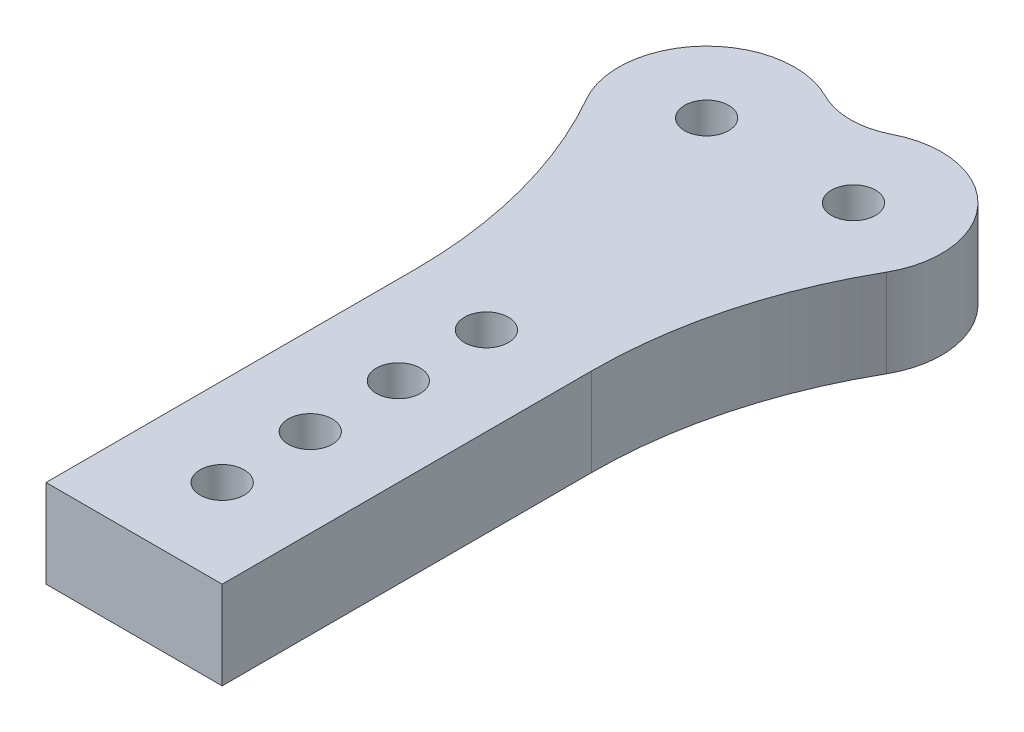
ISO-10303-21;
HEADER;
FILE_DESCRIPTION(('STEP AP214'),'2;1');
FILE_NAME('part.step','',(''),(''),'','','');
FILE_SCHEMA(('AUTOMOTIVE_DESIGN { 1 0 10303 214 1 1 1 1 }'));
ENDSEC;
DATA;
#1=APPLICATION_CONTEXT('core data for automotive mechanical design processes');
#2=APPLICATION_PROTOCOL_DEFINITION('international standard','automotive_design',2000,#1);
#3=PRODUCT_CONTEXT('',#1,'mechanical');
#4=PRODUCT('Part','Part','',(#3));
#5=PRODUCT_RELATED_PRODUCT_CATEGORY('part','',(#4));
#6=PRODUCT_DEFINITION_FORMATION('','',#4);
#7=PRODUCT_DEFINITION_CONTEXT('part definition',#1,'design');
#8=PRODUCT_DEFINITION('design','',#6,#7);
#9=PRODUCT_DEFINITION_SHAPE('','',#8);
#10=(LENGTH_UNIT() NAMED_UNIT(*) SI_UNIT(.MILLI.,.METRE.));
#11=(NAMED_UNIT(*) PLANE_ANGLE_UNIT() SI_UNIT($,.RADIAN.));
#12=(NAMED_UNIT(*) SI_UNIT($,.STERADIAN.) SOLID_ANGLE_UNIT());
#13=UNCERTAINTY_MEASURE_WITH_UNIT(LENGTH_MEASURE(1.E-05),#10,'distance_accuracy_value','');
#14=(GEOMETRIC_REPRESENTATION_CONTEXT(3) GLOBAL_UNCERTAINTY_ASSIGNED_CONTEXT((#13)) GLOBAL_UNIT_ASSIGNED_CONTEXT((#10,
#11,#12)) REPRESENTATION_CONTEXT('',''));
#15=CARTESIAN_POINT('',(0.,0.,0.));
#16=DIRECTION('',(0.,0.,1.));
#17=DIRECTION('',(1.,0.,0.));
#18=AXIS2_PLACEMENT_3D('',#15,#16,#17);
#19=CARTESIAN_POINT('',(-16.9314326925532,3.,1.11222006757747));
#20=DIRECTION('',(1.,0.,0.));
#21=DIRECTION('',(0.,0.,-1.));
#22=AXIS2_PLACEMENT_3D('',#19,#20,#21);
#23=PLANE('',#22);
#24=DIRECTION('',(0.,0.,1.));
#25=VECTOR('',#24,1.);
#26=CARTESIAN_POINT('',(-16.9314326925532,3.,1.11222006757747));
#27=LINE('',#26,#25);
#28=CARTESIAN_POINT('',(-16.9314326925532,3.,10.5329419082859));
#29=VERTEX_POINT('',#28);
#30=CARTESIAN_POINT('',(-16.9314326925532,3.,23.1122200675775));
#31=VERTEX_POINT('',#30);
#32=EDGE_CURVE('E108',#29,#31,#27,.T.);
#33=ORIENTED_EDGE('',*,*,#32,.F.);
#34=DIRECTION('',(0.,1.,0.));
#35=VECTOR('',#34,1.);
#36=CARTESIAN_POINT('',(-16.9314326925532,3.,10.5329419082859));
#37=LINE('',#36,#35);
#38=CARTESIAN_POINT('',(-16.9314326925532,0.,10.5329419082859));
#39=VERTEX_POINT('',#38);
#40=EDGE_CURVE('E149',#29,#39,#37,.F.);
#41=ORIENTED_EDGE('',*,*,#40,.T.);
#42=DIRECTION('',(0.,0.,1.));
#43=VECTOR('',#42,1.);
#44=CARTESIAN_POINT('',(-16.9314326925532,0.,1.11222006757747));
#45=LINE('',#44,#43);
#46=CARTESIAN_POINT('',(-16.9314326925532,0.,23.1122200675775));
#47=VERTEX_POINT('',#46);
#48=EDGE_CURVE('E132',#39,#47,#45,.T.);
#49=ORIENTED_EDGE('',*,*,#48,.T.);
#50=DIRECTION('',(0.,-1.,0.));
#51=VECTOR('',#50,1.);
#52=CARTESIAN_POINT('',(-16.9314326925532,3.,23.1122200675775));
#53=LINE('',#52,#51);
#54=EDGE_CURVE('E125',#31,#47,#53,.T.);
#55=ORIENTED_EDGE('',*,*,#54,.F.);
#56=EDGE_LOOP('',(#33,#41,#49,#55));
#57=FACE_BOUND('',#56,.T.);
#58=ADVANCED_FACE('F47',(#57),#23,.F.);
#59=CARTESIAN_POINT('',(-16.9314326925532,3.,23.1122200675775));
#60=DIRECTION('',(0.,0.,-1.));
#61=DIRECTION('',(-1.,0.,0.));
#62=AXIS2_PLACEMENT_3D('',#59,#60,#61);
#63=PLANE('',#62);
#64=DIRECTION('',(1.,0.,0.));
#65=VECTOR('',#64,1.);
#66=CARTESIAN_POINT('',(-16.9314326925532,0.,23.1122200675775));
#67=LINE('',#66,#65);
#68=CARTESIAN_POINT('',(-10.9314326925532,0.,23.1122200675775));
#69=VERTEX_POINT('',#68);
#70=EDGE_CURVE('E220',#47,#69,#67,.T.);
#71=ORIENTED_EDGE('',*,*,#70,.T.);
#72=DIRECTION('',(0.,-1.,0.));
#73=VECTOR('',#72,1.);
#74=CARTESIAN_POINT('',(-10.9314326925532,3.,23.1122200675775));
#75=LINE('',#74,#73);
#76=CARTESIAN_POINT('',(-10.9314326925532,3.,23.1122200675775));
#77=VERTEX_POINT('',#76);
#78=EDGE_CURVE('E127',#77,#69,#75,.T.);
#79=ORIENTED_EDGE('',*,*,#78,.F.);
#80=DIRECTION('',(1.,0.,0.));
#81=VECTOR('',#80,1.);
#82=CARTESIAN_POINT('',(-16.9314326925532,3.,23.1122200675775));
#83=LINE('',#82,#81);
#84=EDGE_CURVE('E111',#31,#77,#83,.T.);
#85=ORIENTED_EDGE('',*,*,#84,.F.);
#86=ORIENTED_EDGE('',*,*,#54,.T.);
#87=EDGE_LOOP('',(#71,#79,#85,#86));
#88=FACE_BOUND('',#87,.T.);
#89=ADVANCED_FACE('F124',(#88),#63,.F.);
#90=CARTESIAN_POINT('',(-10.9314326925532,3.,1.11222006757747));
#91=DIRECTION('',(-1.,0.,0.));
#92=DIRECTION('',(0.,0.,1.));
#93=AXIS2_PLACEMENT_3D('',#90,#91,#92);
#94=PLANE('',#93);
#95=DIRECTION('',(0.,0.,-1.));
#96=VECTOR('',#95,1.);
#97=CARTESIAN_POINT('',(-10.9314326925532,0.,1.11222006757747));
#98=LINE('',#97,#96);
#99=CARTESIAN_POINT('',(-10.9314326925532,0.,10.5329419082859));
#100=VERTEX_POINT('',#99);
#101=EDGE_CURVE('E120',#69,#100,#98,.T.);
#102=ORIENTED_EDGE('',*,*,#101,.T.);
#103=DIRECTION('',(0.,1.,0.));
#104=VECTOR('',#103,1.);
#105=CARTESIAN_POINT('',(-10.9314326925532,3.,10.5329419082859));
#106=LINE('',#105,#104);
#107=CARTESIAN_POINT('',(-10.9314326925532,3.,10.5329419082859));
#108=VERTEX_POINT('',#107);
#109=EDGE_CURVE('E153',#100,#108,#106,.T.);
#110=ORIENTED_EDGE('',*,*,#109,.T.);
#111=DIRECTION('',(0.,0.,-1.));
#112=VECTOR('',#111,1.);
#113=CARTESIAN_POINT('',(-10.9314326925532,3.,1.11222006757747));
#114=LINE('',#113,#112);
#115=EDGE_CURVE('E129',#77,#108,#114,.T.);
#116=ORIENTED_EDGE('',*,*,#115,.F.);
#117=ORIENTED_EDGE('',*,*,#78,.T.);
#118=EDGE_LOOP('',(#102,#110,#116,#117));
#119=FACE_BOUND('',#118,.T.);
#120=ADVANCED_FACE('F192',(#119),#94,.F.);
#121=CARTESIAN_POINT('',(0.,3.,0.));
#122=DIRECTION('',(0.,1.,0.));
#123=DIRECTION('',(0.,0.,1.));
#124=AXIS2_PLACEMENT_3D('',#121,#122,#123);
#125=PLANE('',#124);
#126=CARTESIAN_POINT('',(-13.9314326925532,3.,20.1122200675775));
#127=DIRECTION('',(0.,1.,0.));
#128=DIRECTION('',(0.,0.,1.));
#129=AXIS2_PLACEMENT_3D('',#126,#127,#128);
#130=CIRCLE('',#129,0.75);
#131=CARTESIAN_POINT('',(-13.9314326925532,3.,20.8622200675775));
#132=VERTEX_POINT('',#131);
#133=EDGE_CURVE('E233',#132,#132,#130,.T.);
#134=ORIENTED_EDGE('',*,*,#133,.F.);
#135=EDGE_LOOP('',(#134));
#136=FACE_BOUND('',#135,.T.);
#137=CARTESIAN_POINT('',(-13.9314326925532,3.,17.1122200675775));
#138=DIRECTION('',(0.,1.,0.));
#139=DIRECTION('',(0.,0.,1.));
#140=AXIS2_PLACEMENT_3D('',#137,#138,#139);
#141=CIRCLE('',#140,0.75);
#142=CARTESIAN_POINT('',(-13.9314326925532,3.,17.8622200675775));
#143=VERTEX_POINT('',#142);
#144=EDGE_CURVE('E240',#143,#143,#141,.T.);
#145=ORIENTED_EDGE('',*,*,#144,.F.);
#146=EDGE_LOOP('',(#145));
#147=FACE_BOUND('',#146,.T.);
#148=CARTESIAN_POINT('',(-13.9314326925532,3.,14.1122200675775));
#149=DIRECTION('',(0.,1.,0.));
#150=DIRECTION('',(0.,0.,1.));
#151=AXIS2_PLACEMENT_3D('',#148,#149,#150);
#152=CIRCLE('',#151,0.75);
#153=CARTESIAN_POINT('',(-13.9314326925532,3.,14.8622200675775));
#154=VERTEX_POINT('',#153);
#155=EDGE_CURVE('E243',#154,#154,#152,.T.);
#156=ORIENTED_EDGE('',*,*,#155,.F.);
#157=EDGE_LOOP('',(#156));
#158=FACE_BOUND('',#157,.T.);
#159=CARTESIAN_POINT('',(-13.9314326925532,3.,11.1122200675775));
#160=DIRECTION('',(0.,1.,0.));
#161=DIRECTION('',(0.,0.,1.));
#162=AXIS2_PLACEMENT_3D('',#159,#160,#161);
#163=CIRCLE('',#162,0.75);
#164=CARTESIAN_POINT('',(-13.9314326925532,3.,11.8622200675775));
#165=VERTEX_POINT('',#164);
#166=EDGE_CURVE('E246',#165,#165,#163,.T.);
#167=ORIENTED_EDGE('',*,*,#166,.F.);
#168=EDGE_LOOP('',(#167));
#169=FACE_BOUND('',#168,.T.);
#170=CARTESIAN_POINT('',(-16.4314326925532,3.,1.11222006757747));
#171=DIRECTION('',(0.,1.,0.));
#172=DIRECTION('',(0.,0.,1.));
#173=AXIS2_PLACEMENT_3D('',#170,#171,#172);
#174=CIRCLE('',#173,0.750000000000002);
#175=CARTESIAN_POINT('',(-16.4314326925532,3.,1.86222006757747));
#176=VERTEX_POINT('',#175);
#177=EDGE_CURVE('E214',#176,#176,#174,.T.);
#178=ORIENTED_EDGE('',*,*,#177,.F.);
#179=EDGE_LOOP('',(#178));
#180=FACE_BOUND('',#179,.T.);
#181=CARTESIAN_POINT('',(-11.4314326925532,3.,1.11222006757747));
#182=DIRECTION('',(0.,1.,0.));
#183=DIRECTION('',(0.,0.,-1.));
#184=AXIS2_PLACEMENT_3D('',#181,#182,#183);
#185=CIRCLE('',#184,0.750000000000002);
#186=CARTESIAN_POINT('',(-11.4314326925532,3.,0.36222006757747));
#187=VERTEX_POINT('',#186);
#188=EDGE_CURVE('E229',#187,#187,#185,.T.);
#189=ORIENTED_EDGE('',*,*,#188,.F.);
#190=EDGE_LOOP('',(#189));
#191=FACE_BOUND('',#190,.T.);
#192=ORIENTED_EDGE('',*,*,#115,.T.);
#193=CARTESIAN_POINT('',(5.06856730744681,3.,10.5329419082859));
#194=DIRECTION('',(0.,1.,0.));
#195=DIRECTION('',(0.,0.,1.));
#196=AXIS2_PLACEMENT_3D('',#193,#194,#195);
#197=CIRCLE('',#196,16.);
#198=CARTESIAN_POINT('',(-8.82616953465845,3.,2.5997024634788));
#199=VERTEX_POINT('',#198);
#200=EDGE_CURVE('E55',#108,#199,#197,.F.);
#201=ORIENTED_EDGE('',*,*,#200,.T.);
#202=CARTESIAN_POINT('',(-11.4314326925532,3.,1.11222006757747));
#203=DIRECTION('',(0.,1.,0.));
#204=DIRECTION('',(0.,0.,1.));
#205=AXIS2_PLACEMENT_3D('',#202,#203,#204);
#206=CIRCLE('',#205,3.);
#207=CARTESIAN_POINT('',(-12.7950690561896,3.,-1.55995056091327));
#208=VERTEX_POINT('',#207);
#209=EDGE_CURVE('E170',#199,#208,#206,.T.);
#210=ORIENTED_EDGE('',*,*,#209,.T.);
#211=CARTESIAN_POINT('',(-13.9314326925532,3.,-3.78675941798888));
#212=DIRECTION('',(0.,1.,0.));
#213=DIRECTION('',(0.,0.,1.));
#214=AXIS2_PLACEMENT_3D('',#211,#212,#213);
#215=CIRCLE('',#214,2.5);
#216=CARTESIAN_POINT('',(-15.0677963289168,3.,-1.55995056091327));
#217=VERTEX_POINT('',#216);
#218=EDGE_CURVE('E147',#208,#217,#215,.F.);
#219=ORIENTED_EDGE('',*,*,#218,.T.);
#220=CARTESIAN_POINT('',(-16.4314326925532,3.,1.11222006757747));
#221=DIRECTION('',(0.,1.,0.));
#222=DIRECTION('',(0.,0.,1.));
#223=AXIS2_PLACEMENT_3D('',#220,#221,#222);
#224=CIRCLE('',#223,3.);
#225=CARTESIAN_POINT('',(-19.0366958504479,3.,2.5997024634788));
#226=VERTEX_POINT('',#225);
#227=EDGE_CURVE('E171',#217,#226,#224,.T.);
#228=ORIENTED_EDGE('',*,*,#227,.T.);
#229=CARTESIAN_POINT('',(-32.9314326925532,3.,10.5329419082859));
#230=DIRECTION('',(0.,1.,0.));
#231=DIRECTION('',(0.,0.,1.));
#232=AXIS2_PLACEMENT_3D('',#229,#230,#231);
#233=CIRCLE('',#232,16.);
#234=EDGE_CURVE('E115',#226,#29,#233,.F.);
#235=ORIENTED_EDGE('',*,*,#234,.T.);
#236=ORIENTED_EDGE('',*,*,#32,.T.);
#237=ORIENTED_EDGE('',*,*,#84,.T.);
#238=EDGE_LOOP('',(#192,#201,#210,#219,#228,#235,#236,#237));
#239=FACE_BOUND('',#238,.T.);
#240=ADVANCED_FACE('F110',(#136,#147,#158,#169,#180,#191,#239),#125,.T.);
#241=CARTESIAN_POINT('',(0.,0.,0.));
#242=DIRECTION('',(0.,1.,0.));
#243=DIRECTION('',(0.,0.,1.));
#244=AXIS2_PLACEMENT_3D('',#241,#242,#243);
#245=PLANE('',#244);
#246=CARTESIAN_POINT('',(-13.9314326925532,0.,20.1122200675775));
#247=DIRECTION('',(0.,-1.,0.));
#248=DIRECTION('',(0.,0.,-1.));
#249=AXIS2_PLACEMENT_3D('',#246,#247,#248);
#250=CIRCLE('',#249,0.75);
#251=CARTESIAN_POINT('',(-13.9314326925532,0.,19.3622200675775));
#252=VERTEX_POINT('',#251);
#253=EDGE_CURVE('E249',#252,#252,#250,.T.);
#254=ORIENTED_EDGE('',*,*,#253,.F.);
#255=EDGE_LOOP('',(#254));
#256=FACE_BOUND('',#255,.T.);
#257=CARTESIAN_POINT('',(-13.9314326925532,0.,17.1122200675775));
#258=DIRECTION('',(0.,-1.,0.));
#259=DIRECTION('',(0.,0.,-1.));
#260=AXIS2_PLACEMENT_3D('',#257,#258,#259);
#261=CIRCLE('',#260,0.75);
#262=CARTESIAN_POINT('',(-13.9314326925532,0.,16.3622200675775));
#263=VERTEX_POINT('',#262);
#264=EDGE_CURVE('E256',#263,#263,#261,.T.);
#265=ORIENTED_EDGE('',*,*,#264,.F.);
#266=EDGE_LOOP('',(#265));
#267=FACE_BOUND('',#266,.T.);
#268=CARTESIAN_POINT('',(-13.9314326925532,0.,14.1122200675775));
#269=DIRECTION('',(0.,-1.,0.));
#270=DIRECTION('',(0.,0.,-1.));
#271=AXIS2_PLACEMENT_3D('',#268,#269,#270);
#272=CIRCLE('',#271,0.75);
#273=CARTESIAN_POINT('',(-13.9314326925532,0.,13.3622200675775));
#274=VERTEX_POINT('',#273);
#275=EDGE_CURVE('E253',#274,#274,#272,.T.);
#276=ORIENTED_EDGE('',*,*,#275,.F.);
#277=EDGE_LOOP('',(#276));
#278=FACE_BOUND('',#277,.T.);
#279=CARTESIAN_POINT('',(-13.9314326925532,0.,11.1122200675775));
#280=DIRECTION('',(0.,-1.,0.));
#281=DIRECTION('',(0.,0.,-1.));
#282=AXIS2_PLACEMENT_3D('',#279,#280,#281);
#283=CIRCLE('',#282,0.75);
#284=CARTESIAN_POINT('',(-13.9314326925532,0.,10.3622200675775));
#285=VERTEX_POINT('',#284);
#286=EDGE_CURVE('E250',#285,#285,#283,.T.);
#287=ORIENTED_EDGE('',*,*,#286,.F.);
#288=EDGE_LOOP('',(#287));
#289=FACE_BOUND('',#288,.T.);
#290=CARTESIAN_POINT('',(-16.4314326925532,0.,1.11222006757747));
#291=DIRECTION('',(0.,1.,0.));
#292=DIRECTION('',(0.,0.,1.));
#293=AXIS2_PLACEMENT_3D('',#290,#291,#292);
#294=CIRCLE('',#293,0.750000000000002);
#295=CARTESIAN_POINT('',(-16.4314326925532,0.,1.86222006757747));
#296=VERTEX_POINT('',#295);
#297=EDGE_CURVE('E211',#296,#296,#294,.T.);
#298=ORIENTED_EDGE('',*,*,#297,.T.);
#299=EDGE_LOOP('',(#298));
#300=FACE_BOUND('',#299,.T.);
#301=CARTESIAN_POINT('',(-11.4314326925532,0.,1.11222006757747));
#302=DIRECTION('',(0.,1.,0.));
#303=DIRECTION('',(0.,0.,-1.));
#304=AXIS2_PLACEMENT_3D('',#301,#302,#303);
#305=CIRCLE('',#304,0.750000000000002);
#306=CARTESIAN_POINT('',(-11.4314326925532,0.,0.36222006757747));
#307=VERTEX_POINT('',#306);
#308=EDGE_CURVE('E232',#307,#307,#305,.T.);
#309=ORIENTED_EDGE('',*,*,#308,.T.);
#310=EDGE_LOOP('',(#309));
#311=FACE_BOUND('',#310,.T.);
#312=ORIENTED_EDGE('',*,*,#48,.F.);
#313=CARTESIAN_POINT('',(-32.9314326925532,0.,10.5329419082859));
#314=DIRECTION('',(0.,1.,0.));
#315=DIRECTION('',(0.,0.,1.));
#316=AXIS2_PLACEMENT_3D('',#313,#314,#315);
#317=CIRCLE('',#316,16.);
#318=CARTESIAN_POINT('',(-19.0366958504479,0.,2.5997024634788));
#319=VERTEX_POINT('',#318);
#320=EDGE_CURVE('E157',#39,#319,#317,.T.);
#321=ORIENTED_EDGE('',*,*,#320,.T.);
#322=CARTESIAN_POINT('',(-16.4314326925532,0.,1.11222006757747));
#323=DIRECTION('',(0.,1.,0.));
#324=DIRECTION('',(0.,0.,1.));
#325=AXIS2_PLACEMENT_3D('',#322,#323,#324);
#326=CIRCLE('',#325,3.);
#327=CARTESIAN_POINT('',(-15.0677963289168,0.,-1.55995056091327));
#328=VERTEX_POINT('',#327);
#329=EDGE_CURVE('E163',#328,#319,#326,.T.);
#330=ORIENTED_EDGE('',*,*,#329,.F.);
#331=CARTESIAN_POINT('',(-13.9314326925532,0.,-3.78675941798888));
#332=DIRECTION('',(0.,1.,0.));
#333=DIRECTION('',(0.,0.,1.));
#334=AXIS2_PLACEMENT_3D('',#331,#332,#333);
#335=CIRCLE('',#334,2.5);
#336=CARTESIAN_POINT('',(-12.7950690561896,0.,-1.55995056091327));
#337=VERTEX_POINT('',#336);
#338=EDGE_CURVE('E144',#328,#337,#335,.T.);
#339=ORIENTED_EDGE('',*,*,#338,.T.);
#340=CARTESIAN_POINT('',(-11.4314326925532,0.,1.11222006757747));
#341=DIRECTION('',(0.,1.,0.));
#342=DIRECTION('',(0.,0.,1.));
#343=AXIS2_PLACEMENT_3D('',#340,#341,#342);
#344=CIRCLE('',#343,3.);
#345=CARTESIAN_POINT('',(-8.82616953465845,0.,2.5997024634788));
#346=VERTEX_POINT('',#345);
#347=EDGE_CURVE('E221',#346,#337,#344,.T.);
#348=ORIENTED_EDGE('',*,*,#347,.F.);
#349=CARTESIAN_POINT('',(5.06856730744681,0.,10.5329419082859));
#350=DIRECTION('',(0.,1.,0.));
#351=DIRECTION('',(0.,0.,1.));
#352=AXIS2_PLACEMENT_3D('',#349,#350,#351);
#353=CIRCLE('',#352,16.);
#354=EDGE_CURVE('E12',#346,#100,#353,.T.);
#355=ORIENTED_EDGE('',*,*,#354,.T.);
#356=ORIENTED_EDGE('',*,*,#101,.F.);
#357=ORIENTED_EDGE('',*,*,#70,.F.);
#358=EDGE_LOOP('',(#312,#321,#330,#339,#348,#355,#356,#357));
#359=FACE_BOUND('',#358,.T.);
#360=ADVANCED_FACE('F162',(#256,#267,#278,#289,#300,#311,#359),#245,.F.);
#361=CARTESIAN_POINT('',(-16.4314326925532,0.,1.11222006757747));
#362=DIRECTION('',(0.,1.,0.));
#363=DIRECTION('',(0.,0.,1.));
#364=AXIS2_PLACEMENT_3D('',#361,#362,#363);
#365=CYLINDRICAL_SURFACE('',#364,3.);
#366=ORIENTED_EDGE('',*,*,#329,.T.);
#367=DIRECTION('',(0.,1.,0.));
#368=VECTOR('',#367,1.);
#369=CARTESIAN_POINT('',(-19.0366958504479,0.,2.5997024634788));
#370=LINE('',#369,#368);
#371=EDGE_CURVE('E151',#319,#226,#370,.T.);
#372=ORIENTED_EDGE('',*,*,#371,.T.);
#373=ORIENTED_EDGE('',*,*,#227,.F.);
#374=DIRECTION('',(0.,1.,0.));
#375=VECTOR('',#374,1.);
#376=CARTESIAN_POINT('',(-15.0677963289168,0.,-1.55995056091327));
#377=LINE('',#376,#375);
#378=EDGE_CURVE('E134',#217,#328,#377,.F.);
#379=ORIENTED_EDGE('',*,*,#378,.T.);
#380=EDGE_LOOP('',(#366,#372,#373,#379));
#381=FACE_BOUND('',#380,.T.);
#382=ADVANCED_FACE('F167',(#381),#365,.T.);
#383=CARTESIAN_POINT('',(-11.4314326925532,0.,1.11222006757747));
#384=DIRECTION('',(0.,1.,0.));
#385=DIRECTION('',(0.,0.,1.));
#386=AXIS2_PLACEMENT_3D('',#383,#384,#385);
#387=CYLINDRICAL_SURFACE('',#386,3.);
#388=ORIENTED_EDGE('',*,*,#209,.F.);
#389=DIRECTION('',(0.,1.,0.));
#390=VECTOR('',#389,1.);
#391=CARTESIAN_POINT('',(-8.82616953465845,0.,2.5997024634788));
#392=LINE('',#391,#390);
#393=EDGE_CURVE('E68',#199,#346,#392,.F.);
#394=ORIENTED_EDGE('',*,*,#393,.T.);
#395=ORIENTED_EDGE('',*,*,#347,.T.);
#396=DIRECTION('',(0.,1.,0.));
#397=VECTOR('',#396,1.);
#398=CARTESIAN_POINT('',(-12.7950690561896,0.,-1.55995056091327));
#399=LINE('',#398,#397);
#400=EDGE_CURVE('E137',#337,#208,#399,.T.);
#401=ORIENTED_EDGE('',*,*,#400,.T.);
#402=EDGE_LOOP('',(#388,#394,#395,#401));
#403=FACE_BOUND('',#402,.T.);
#404=ADVANCED_FACE('F198',(#403),#387,.T.);
#405=CARTESIAN_POINT('',(-13.9314326925532,0.,-3.78675941798888));
#406=DIRECTION('',(0.,1.,0.));
#407=DIRECTION('',(0.,0.,1.));
#408=AXIS2_PLACEMENT_3D('',#405,#406,#407);
#409=CYLINDRICAL_SURFACE('',#408,2.5);
#410=ORIENTED_EDGE('',*,*,#218,.F.);
#411=ORIENTED_EDGE('',*,*,#400,.F.);
#412=ORIENTED_EDGE('',*,*,#338,.F.);
#413=ORIENTED_EDGE('',*,*,#378,.F.);
#414=EDGE_LOOP('',(#410,#411,#412,#413));
#415=FACE_BOUND('',#414,.T.);
#416=ADVANCED_FACE('F195',(#415),#409,.F.);
#417=CARTESIAN_POINT('',(-11.4314326925532,0.,1.11222006757747));
#418=DIRECTION('',(0.,1.,0.));
#419=DIRECTION('',(0.,0.,1.));
#420=AXIS2_PLACEMENT_3D('',#417,#418,#419);
#421=CYLINDRICAL_SURFACE('',#420,0.750000000000002);
#422=ORIENTED_EDGE('',*,*,#308,.F.);
#423=EDGE_LOOP('',(#422));
#424=FACE_BOUND('',#423,.T.);
#425=ORIENTED_EDGE('',*,*,#188,.T.);
#426=EDGE_LOOP('',(#425));
#427=FACE_BOUND('',#426,.T.);
#428=ADVANCED_FACE('F197',(#424,#427),#421,.F.);
#429=CARTESIAN_POINT('',(-16.4314326925532,0.,1.11222006757747));
#430=DIRECTION('',(0.,1.,0.));
#431=DIRECTION('',(0.,0.,1.));
#432=AXIS2_PLACEMENT_3D('',#429,#430,#431);
#433=CYLINDRICAL_SURFACE('',#432,0.750000000000002);
#434=ORIENTED_EDGE('',*,*,#297,.F.);
#435=EDGE_LOOP('',(#434));
#436=FACE_BOUND('',#435,.T.);
#437=ORIENTED_EDGE('',*,*,#177,.T.);
#438=EDGE_LOOP('',(#437));
#439=FACE_BOUND('',#438,.T.);
#440=ADVANCED_FACE('F204',(#436,#439),#433,.F.);
#441=CARTESIAN_POINT('',(-13.9314326925532,10.,11.1122200675775));
#442=DIRECTION('',(0.,-1.,0.));
#443=DIRECTION('',(0.,0.,-1.));
#444=AXIS2_PLACEMENT_3D('',#441,#442,#443);
#445=CYLINDRICAL_SURFACE('',#444,0.75);
#446=ORIENTED_EDGE('',*,*,#166,.T.);
#447=EDGE_LOOP('',(#446));
#448=FACE_BOUND('',#447,.T.);
#449=ORIENTED_EDGE('',*,*,#286,.T.);
#450=EDGE_LOOP('',(#449));
#451=FACE_BOUND('',#450,.T.);
#452=ADVANCED_FACE('F290',(#448,#451),#445,.F.);
#453=CARTESIAN_POINT('',(-13.9314326925532,10.,14.1122200675775));
#454=DIRECTION('',(0.,-1.,0.));
#455=DIRECTION('',(0.,0.,-1.));
#456=AXIS2_PLACEMENT_3D('',#453,#454,#455);
#457=CYLINDRICAL_SURFACE('',#456,0.75);
#458=ORIENTED_EDGE('',*,*,#155,.T.);
#459=EDGE_LOOP('',(#458));
#460=FACE_BOUND('',#459,.T.);
#461=ORIENTED_EDGE('',*,*,#275,.T.);
#462=EDGE_LOOP('',(#461));
#463=FACE_BOUND('',#462,.T.);
#464=ADVANCED_FACE('F294',(#460,#463),#457,.F.);
#465=CARTESIAN_POINT('',(-13.9314326925532,10.,17.1122200675775));
#466=DIRECTION('',(0.,-1.,0.));
#467=DIRECTION('',(0.,0.,-1.));
#468=AXIS2_PLACEMENT_3D('',#465,#466,#467);
#469=CYLINDRICAL_SURFACE('',#468,0.75);
#470=ORIENTED_EDGE('',*,*,#144,.T.);
#471=EDGE_LOOP('',(#470));
#472=FACE_BOUND('',#471,.T.);
#473=ORIENTED_EDGE('',*,*,#264,.T.);
#474=EDGE_LOOP('',(#473));
#475=FACE_BOUND('',#474,.T.);
#476=ADVANCED_FACE('F181',(#472,#475),#469,.F.);
#477=CARTESIAN_POINT('',(-13.9314326925532,10.,20.1122200675775));
#478=DIRECTION('',(0.,-1.,0.));
#479=DIRECTION('',(0.,0.,-1.));
#480=AXIS2_PLACEMENT_3D('',#477,#478,#479);
#481=CYLINDRICAL_SURFACE('',#480,0.75);
#482=ORIENTED_EDGE('',*,*,#133,.T.);
#483=EDGE_LOOP('',(#482));
#484=FACE_BOUND('',#483,.T.);
#485=ORIENTED_EDGE('',*,*,#253,.T.);
#486=EDGE_LOOP('',(#485));
#487=FACE_BOUND('',#486,.T.);
#488=ADVANCED_FACE('F175',(#484,#487),#481,.F.);
#489=CARTESIAN_POINT('',(-32.9314326925532,0.,10.5329419082859));
#490=DIRECTION('',(0.,1.,0.));
#491=DIRECTION('',(0.,0.,1.));
#492=AXIS2_PLACEMENT_3D('',#489,#490,#491);
#493=CYLINDRICAL_SURFACE('',#492,16.);
#494=ORIENTED_EDGE('',*,*,#234,.F.);
#495=ORIENTED_EDGE('',*,*,#371,.F.);
#496=ORIENTED_EDGE('',*,*,#320,.F.);
#497=ORIENTED_EDGE('',*,*,#40,.F.);
#498=EDGE_LOOP('',(#494,#495,#496,#497));
#499=FACE_BOUND('',#498,.T.);
#500=ADVANCED_FACE('F173',(#499),#493,.F.);
#501=CARTESIAN_POINT('',(5.06856730744681,0.,10.5329419082859));
#502=DIRECTION('',(0.,1.,0.));
#503=DIRECTION('',(0.,0.,1.));
#504=AXIS2_PLACEMENT_3D('',#501,#502,#503);
#505=CYLINDRICAL_SURFACE('',#504,16.);
#506=ORIENTED_EDGE('',*,*,#354,.F.);
#507=ORIENTED_EDGE('',*,*,#393,.F.);
#508=ORIENTED_EDGE('',*,*,#200,.F.);
#509=ORIENTED_EDGE('',*,*,#109,.F.);
#510=EDGE_LOOP('',(#506,#507,#508,#509));
#511=FACE_BOUND('',#510,.T.);
#512=ADVANCED_FACE('F49',(#511),#505,.F.);
#513=CLOSED_SHELL('',(#58,#89,#120,#240,#360,#382,#404,#416,#428,#440,#452,#464,#476,#488,#500,#512));
#514=MANIFOLD_SOLID_BREP('B2',#513);
#515=ADVANCED_BREP_SHAPE_REPRESENTATION('',(#18,#514),#14);
#516=SHAPE_DEFINITION_REPRESENTATION(#9,#515);
ENDSEC;
END-ISO-10303-21;
